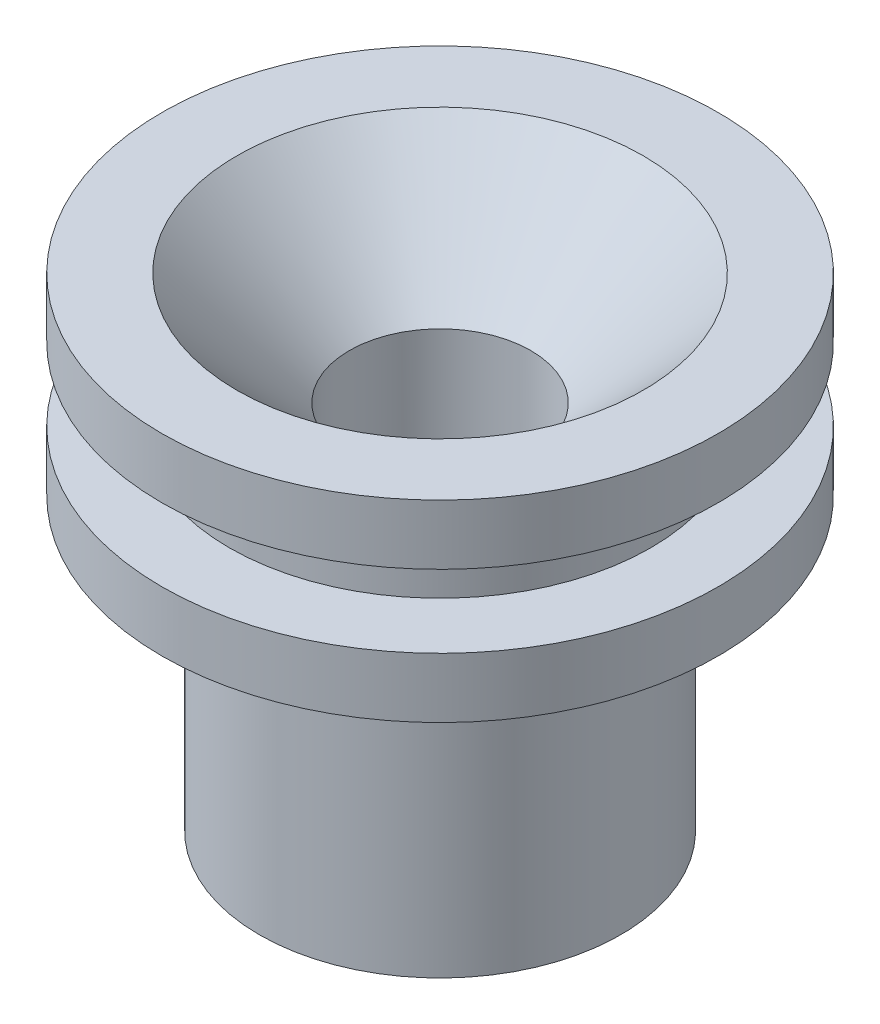
ISO-10303-21;
HEADER;
FILE_DESCRIPTION(('STEP AP214'),'2;1');
FILE_NAME('part.step','',(''),(''),'','','');
FILE_SCHEMA(('AUTOMOTIVE_DESIGN { 1 0 10303 214 1 1 1 1 }'));
ENDSEC;
DATA;
#1=APPLICATION_CONTEXT('core data for automotive mechanical design processes');
#2=APPLICATION_PROTOCOL_DEFINITION('international standard','automotive_design',2000,#1);
#3=PRODUCT_CONTEXT('',#1,'mechanical');
#4=PRODUCT('Part','Part','',(#3));
#5=PRODUCT_RELATED_PRODUCT_CATEGORY('part','',(#4));
#6=PRODUCT_DEFINITION_FORMATION('','',#4);
#7=PRODUCT_DEFINITION_CONTEXT('part definition',#1,'design');
#8=PRODUCT_DEFINITION('design','',#6,#7);
#9=PRODUCT_DEFINITION_SHAPE('','',#8);
#10=(LENGTH_UNIT() NAMED_UNIT(*) SI_UNIT(.MILLI.,.METRE.));
#11=(NAMED_UNIT(*) PLANE_ANGLE_UNIT() SI_UNIT($,.RADIAN.));
#12=(NAMED_UNIT(*) SI_UNIT($,.STERADIAN.) SOLID_ANGLE_UNIT());
#13=UNCERTAINTY_MEASURE_WITH_UNIT(LENGTH_MEASURE(1.E-05),#10,'distance_accuracy_value','');
#14=(GEOMETRIC_REPRESENTATION_CONTEXT(3) GLOBAL_UNCERTAINTY_ASSIGNED_CONTEXT((#13)) GLOBAL_UNIT_ASSIGNED_CONTEXT((#10,
#11,#12)) REPRESENTATION_CONTEXT('',''));
#15=CARTESIAN_POINT('',(0.,0.,0.));
#16=DIRECTION('',(0.,0.,1.));
#17=DIRECTION('',(1.,0.,0.));
#18=AXIS2_PLACEMENT_3D('',#15,#16,#17);
#19=CARTESIAN_POINT('',(0.,0.,0.));
#20=DIRECTION('',(0.,1.,0.));
#21=DIRECTION('',(0.,0.,1.));
#22=AXIS2_PLACEMENT_3D('',#19,#20,#21);
#23=PLANE('',#22);
#24=CARTESIAN_POINT('',(0.,0.,0.));
#25=DIRECTION('',(0.,-1.,0.));
#26=DIRECTION('',(0.,0.,-1.));
#27=AXIS2_PLACEMENT_3D('',#24,#25,#26);
#28=CIRCLE('',#27,1.5494);
#29=CARTESIAN_POINT('',(0.,0.,-1.5494));
#30=VERTEX_POINT('',#29);
#31=EDGE_CURVE('E56',#30,#30,#28,.T.);
#32=ORIENTED_EDGE('',*,*,#31,.F.);
#33=EDGE_LOOP('',(#32));
#34=FACE_BOUND('',#33,.T.);
#35=CARTESIAN_POINT('',(0.,0.,0.));
#36=DIRECTION('',(0.,1.,0.));
#37=DIRECTION('',(0.,0.,1.));
#38=AXIS2_PLACEMENT_3D('',#35,#36,#37);
#39=CIRCLE('',#38,6.1214);
#40=CARTESIAN_POINT('',(0.,0.,6.1214));
#41=VERTEX_POINT('',#40);
#42=EDGE_CURVE('E46',#41,#41,#39,.T.);
#43=ORIENTED_EDGE('',*,*,#42,.F.);
#44=EDGE_LOOP('',(#43));
#45=FACE_BOUND('',#44,.T.);
#46=ADVANCED_FACE('F34',(#34,#45),#23,.F.);
#47=CARTESIAN_POINT('',(0.,16.3576,0.));
#48=DIRECTION('',(0.,1.,0.));
#49=DIRECTION('',(0.,0.,1.));
#50=AXIS2_PLACEMENT_3D('',#47,#48,#49);
#51=CYLINDRICAL_SURFACE('',#50,6.1214);
#52=CARTESIAN_POINT('',(0.,9.8298,0.));
#53=DIRECTION('',(0.,1.,0.));
#54=DIRECTION('',(0.,0.,1.));
#55=AXIS2_PLACEMENT_3D('',#52,#53,#54);
#56=CIRCLE('',#55,6.1214);
#57=CARTESIAN_POINT('',(0.,9.8298,6.1214));
#58=VERTEX_POINT('',#57);
#59=EDGE_CURVE('E50',#58,#58,#56,.T.);
#60=ORIENTED_EDGE('',*,*,#59,.F.);
#61=EDGE_LOOP('',(#60));
#62=FACE_BOUND('',#61,.T.);
#63=ORIENTED_EDGE('',*,*,#42,.T.);
#64=EDGE_LOOP('',(#63));
#65=FACE_BOUND('',#64,.T.);
#66=ADVANCED_FACE('F87',(#62,#65),#51,.T.);
#67=CARTESIAN_POINT('',(9.4234,9.8298,0.));
#68=DIRECTION('',(0.,1.,0.));
#69=DIRECTION('',(0.,0.,1.));
#70=AXIS2_PLACEMENT_3D('',#67,#68,#69);
#71=PLANE('',#70);
#72=CARTESIAN_POINT('',(0.,9.8298,0.));
#73=DIRECTION('',(0.,1.,0.));
#74=DIRECTION('',(0.,0.,1.));
#75=AXIS2_PLACEMENT_3D('',#72,#73,#74);
#76=CIRCLE('',#75,9.4234);
#77=CARTESIAN_POINT('',(0.,9.8298,9.4234));
#78=VERTEX_POINT('',#77);
#79=EDGE_CURVE('E60',#78,#78,#76,.T.);
#80=ORIENTED_EDGE('',*,*,#79,.F.);
#81=EDGE_LOOP('',(#80));
#82=FACE_BOUND('',#81,.T.);
#83=ORIENTED_EDGE('',*,*,#59,.T.);
#84=EDGE_LOOP('',(#83));
#85=FACE_BOUND('',#84,.T.);
#86=ADVANCED_FACE('F91',(#82,#85),#71,.F.);
#87=CARTESIAN_POINT('',(0.,16.3576,0.));
#88=DIRECTION('',(0.,1.,0.));
#89=DIRECTION('',(0.,0.,1.));
#90=AXIS2_PLACEMENT_3D('',#87,#88,#89);
#91=CYLINDRICAL_SURFACE('',#90,9.4234);
#92=CARTESIAN_POINT('',(0.,11.8618,0.));
#93=DIRECTION('',(0.,1.,0.));
#94=DIRECTION('',(0.,0.,1.));
#95=AXIS2_PLACEMENT_3D('',#92,#93,#94);
#96=CIRCLE('',#95,9.4234);
#97=CARTESIAN_POINT('',(0.,11.8618,9.4234));
#98=VERTEX_POINT('',#97);
#99=EDGE_CURVE('E63',#98,#98,#96,.T.);
#100=ORIENTED_EDGE('',*,*,#99,.F.);
#101=EDGE_LOOP('',(#100));
#102=FACE_BOUND('',#101,.T.);
#103=ORIENTED_EDGE('',*,*,#79,.T.);
#104=EDGE_LOOP('',(#103));
#105=FACE_BOUND('',#104,.T.);
#106=ADVANCED_FACE('F97',(#102,#105),#91,.T.);
#107=CARTESIAN_POINT('',(9.4234,11.8618,0.));
#108=DIRECTION('',(0.,-1.,0.));
#109=DIRECTION('',(0.,0.,-1.));
#110=AXIS2_PLACEMENT_3D('',#107,#108,#109);
#111=PLANE('',#110);
#112=CARTESIAN_POINT('',(0.,11.8618,0.));
#113=DIRECTION('',(0.,1.,0.));
#114=DIRECTION('',(0.,0.,1.));
#115=AXIS2_PLACEMENT_3D('',#112,#113,#114);
#116=CIRCLE('',#115,7.1374);
#117=CARTESIAN_POINT('',(0.,11.8618,7.1374));
#118=VERTEX_POINT('',#117);
#119=EDGE_CURVE('E66',#118,#118,#116,.T.);
#120=ORIENTED_EDGE('',*,*,#119,.F.);
#121=EDGE_LOOP('',(#120));
#122=FACE_BOUND('',#121,.T.);
#123=ORIENTED_EDGE('',*,*,#99,.T.);
#124=EDGE_LOOP('',(#123));
#125=FACE_BOUND('',#124,.T.);
#126=ADVANCED_FACE('F104',(#122,#125),#111,.F.);
#127=CARTESIAN_POINT('',(0.,16.3576,0.));
#128=DIRECTION('',(0.,1.,0.));
#129=DIRECTION('',(0.,0.,1.));
#130=AXIS2_PLACEMENT_3D('',#127,#128,#129);
#131=CYLINDRICAL_SURFACE('',#130,7.1374);
#132=CARTESIAN_POINT('',(0.,14.3256,0.));
#133=DIRECTION('',(0.,1.,0.));
#134=DIRECTION('',(0.,0.,1.));
#135=AXIS2_PLACEMENT_3D('',#132,#133,#134);
#136=CIRCLE('',#135,7.1374);
#137=CARTESIAN_POINT('',(0.,14.3256,7.1374));
#138=VERTEX_POINT('',#137);
#139=EDGE_CURVE('E69',#138,#138,#136,.T.);
#140=ORIENTED_EDGE('',*,*,#139,.F.);
#141=EDGE_LOOP('',(#140));
#142=FACE_BOUND('',#141,.T.);
#143=ORIENTED_EDGE('',*,*,#119,.T.);
#144=EDGE_LOOP('',(#143));
#145=FACE_BOUND('',#144,.T.);
#146=ADVANCED_FACE('F108',(#142,#145),#131,.T.);
#147=CARTESIAN_POINT('',(7.1374,14.3256,0.));
#148=DIRECTION('',(0.,1.,0.));
#149=DIRECTION('',(0.,0.,1.));
#150=AXIS2_PLACEMENT_3D('',#147,#148,#149);
#151=PLANE('',#150);
#152=CARTESIAN_POINT('',(0.,14.3256,0.));
#153=DIRECTION('',(0.,1.,0.));
#154=DIRECTION('',(0.,0.,1.));
#155=AXIS2_PLACEMENT_3D('',#152,#153,#154);
#156=CIRCLE('',#155,9.4234);
#157=CARTESIAN_POINT('',(0.,14.3256,9.4234));
#158=VERTEX_POINT('',#157);
#159=EDGE_CURVE('E72',#158,#158,#156,.T.);
#160=ORIENTED_EDGE('',*,*,#159,.F.);
#161=EDGE_LOOP('',(#160));
#162=FACE_BOUND('',#161,.T.);
#163=ORIENTED_EDGE('',*,*,#139,.T.);
#164=EDGE_LOOP('',(#163));
#165=FACE_BOUND('',#164,.T.);
#166=ADVANCED_FACE('F112',(#162,#165),#151,.F.);
#167=CARTESIAN_POINT('',(0.,16.3576,0.));
#168=DIRECTION('',(0.,1.,0.));
#169=DIRECTION('',(0.,0.,1.));
#170=AXIS2_PLACEMENT_3D('',#167,#168,#169);
#171=CYLINDRICAL_SURFACE('',#170,9.4234);
#172=CARTESIAN_POINT('',(0.,16.3576,0.));
#173=DIRECTION('',(0.,1.,0.));
#174=DIRECTION('',(0.,0.,1.));
#175=AXIS2_PLACEMENT_3D('',#172,#173,#174);
#176=CIRCLE('',#175,9.4234);
#177=CARTESIAN_POINT('',(0.,16.3576,9.4234));
#178=VERTEX_POINT('',#177);
#179=EDGE_CURVE('E75',#178,#178,#176,.T.);
#180=ORIENTED_EDGE('',*,*,#179,.F.);
#181=EDGE_LOOP('',(#180));
#182=FACE_BOUND('',#181,.T.);
#183=ORIENTED_EDGE('',*,*,#159,.T.);
#184=EDGE_LOOP('',(#183));
#185=FACE_BOUND('',#184,.T.);
#186=ADVANCED_FACE('F116',(#182,#185),#171,.T.);
#187=CARTESIAN_POINT('',(9.4234,16.3576,0.));
#188=DIRECTION('',(0.,-1.,0.));
#189=DIRECTION('',(0.,0.,-1.));
#190=AXIS2_PLACEMENT_3D('',#187,#188,#189);
#191=PLANE('',#190);
#192=CARTESIAN_POINT('',(0.,16.3576,0.));
#193=DIRECTION('',(0.,-1.,0.));
#194=DIRECTION('',(0.,0.,-1.));
#195=AXIS2_PLACEMENT_3D('',#192,#193,#194);
#196=CIRCLE('',#195,6.88340000000004);
#197=CARTESIAN_POINT('',(0.,16.3576,-6.88340000000004));
#198=VERTEX_POINT('',#197);
#199=EDGE_CURVE('E10',#198,#198,#196,.T.);
#200=ORIENTED_EDGE('',*,*,#199,.T.);
#201=EDGE_LOOP('',(#200));
#202=FACE_BOUND('',#201,.T.);
#203=ORIENTED_EDGE('',*,*,#179,.T.);
#204=EDGE_LOOP('',(#203));
#205=FACE_BOUND('',#204,.T.);
#206=ADVANCED_FACE('F120',(#202,#205),#191,.F.);
#207=CARTESIAN_POINT('',(0.,0.863599999999999,0.));
#208=DIRECTION('',(0.,1.,0.));
#209=DIRECTION('',(0.,0.,1.));
#210=AXIS2_PLACEMENT_3D('',#207,#208,#209);
#211=CYLINDRICAL_SURFACE('',#210,3.0734);
#212=CARTESIAN_POINT('',(0.,12.5476,0.));
#213=DIRECTION('',(0.,-1.,0.));
#214=DIRECTION('',(0.,0.,-1.));
#215=AXIS2_PLACEMENT_3D('',#212,#213,#214);
#216=CIRCLE('',#215,3.0734);
#217=CARTESIAN_POINT('',(0.,12.5476,-3.0734));
#218=VERTEX_POINT('',#217);
#219=EDGE_CURVE('E42',#218,#218,#216,.F.);
#220=ORIENTED_EDGE('',*,*,#219,.T.);
#221=EDGE_LOOP('',(#220));
#222=FACE_BOUND('',#221,.T.);
#223=CARTESIAN_POINT('',(0.,0.863599999999999,0.));
#224=DIRECTION('',(0.,1.,0.));
#225=DIRECTION('',(0.,0.,1.));
#226=AXIS2_PLACEMENT_3D('',#223,#224,#225);
#227=CIRCLE('',#226,3.0734);
#228=CARTESIAN_POINT('',(0.,0.863599999999999,3.0734));
#229=VERTEX_POINT('',#228);
#230=EDGE_CURVE('E55',#229,#229,#227,.T.);
#231=ORIENTED_EDGE('',*,*,#230,.F.);
#232=EDGE_LOOP('',(#231));
#233=FACE_BOUND('',#232,.T.);
#234=ADVANCED_FACE('F124',(#222,#233),#211,.F.);
#235=CARTESIAN_POINT('',(0.,0.863599999999999,0.));
#236=DIRECTION('',(0.,1.,0.));
#237=DIRECTION('',(0.,0.,1.));
#238=AXIS2_PLACEMENT_3D('',#235,#236,#237);
#239=PLANE('',#238);
#240=CARTESIAN_POINT('',(0.,0.863599999999999,0.));
#241=DIRECTION('',(0.,1.,0.));
#242=DIRECTION('',(0.,0.,1.));
#243=AXIS2_PLACEMENT_3D('',#240,#241,#242);
#244=CIRCLE('',#243,1.5494);
#245=CARTESIAN_POINT('',(0.,0.863599999999999,1.5494));
#246=VERTEX_POINT('',#245);
#247=EDGE_CURVE('E53',#246,#246,#244,.T.);
#248=ORIENTED_EDGE('',*,*,#247,.F.);
#249=EDGE_LOOP('',(#248));
#250=FACE_BOUND('',#249,.T.);
#251=ORIENTED_EDGE('',*,*,#230,.T.);
#252=EDGE_LOOP('',(#251));
#253=FACE_BOUND('',#252,.T.);
#254=ADVANCED_FACE('F127',(#250,#253),#239,.T.);
#255=CARTESIAN_POINT('',(0.,16.3576,0.));
#256=DIRECTION('',(0.,-1.,0.));
#257=DIRECTION('',(0.,0.,-1.));
#258=AXIS2_PLACEMENT_3D('',#255,#256,#257);
#259=CYLINDRICAL_SURFACE('',#258,1.5494);
#260=ORIENTED_EDGE('',*,*,#247,.T.);
#261=EDGE_LOOP('',(#260));
#262=FACE_BOUND('',#261,.T.);
#263=ORIENTED_EDGE('',*,*,#31,.T.);
#264=EDGE_LOOP('',(#263));
#265=FACE_BOUND('',#264,.T.);
#266=ADVANCED_FACE('F83',(#262,#265),#259,.F.);
#267=CARTESIAN_POINT('',(0.,12.5476,0.));
#268=DIRECTION('',(0.,1.,0.));
#269=DIRECTION('',(0.,0.,1.));
#270=AXIS2_PLACEMENT_3D('',#267,#268,#269);
#271=CONICAL_SURFACE('',#270,3.0734,0.78539816339745);
#272=ORIENTED_EDGE('',*,*,#199,.F.);
#273=EDGE_LOOP('',(#272));
#274=FACE_BOUND('',#273,.T.);
#275=ORIENTED_EDGE('',*,*,#219,.F.);
#276=EDGE_LOOP('',(#275));
#277=FACE_BOUND('',#276,.T.);
#278=ADVANCED_FACE('F37',(#274,#277),#271,.F.);
#279=CLOSED_SHELL('',(#46,#66,#86,#106,#126,#146,#166,#186,#206,#234,#254,#266,#278));
#280=MANIFOLD_SOLID_BREP('B2',#279);
#281=ADVANCED_BREP_SHAPE_REPRESENTATION('',(#18,#280),#14);
#282=SHAPE_DEFINITION_REPRESENTATION(#9,#281);
ENDSEC;
END-ISO-10303-21;
